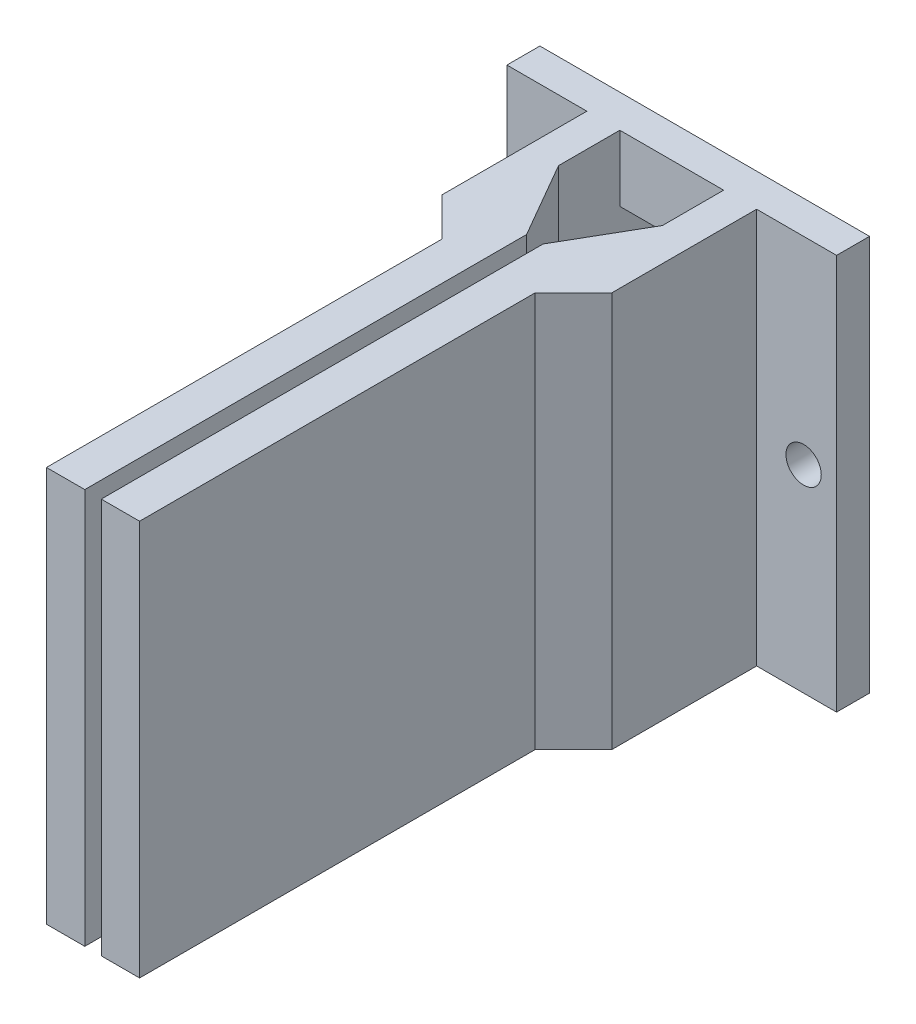
ISO-10303-21;
HEADER;
FILE_DESCRIPTION(('STEP AP214'),'2;1');
FILE_NAME('part.step','',(''),(''),'','','');
FILE_SCHEMA(('AUTOMOTIVE_DESIGN { 1 0 10303 214 1 1 1 1 }'));
ENDSEC;
DATA;
#1=APPLICATION_CONTEXT('core data for automotive mechanical design processes');
#2=APPLICATION_PROTOCOL_DEFINITION('international standard','automotive_design',2000,#1);
#3=PRODUCT_CONTEXT('',#1,'mechanical');
#4=PRODUCT('Part','Part','',(#3));
#5=PRODUCT_RELATED_PRODUCT_CATEGORY('part','',(#4));
#6=PRODUCT_DEFINITION_FORMATION('','',#4);
#7=PRODUCT_DEFINITION_CONTEXT('part definition',#1,'design');
#8=PRODUCT_DEFINITION('design','',#6,#7);
#9=PRODUCT_DEFINITION_SHAPE('','',#8);
#10=(LENGTH_UNIT() NAMED_UNIT(*) SI_UNIT(.MILLI.,.METRE.));
#11=(NAMED_UNIT(*) PLANE_ANGLE_UNIT() SI_UNIT($,.RADIAN.));
#12=(NAMED_UNIT(*) SI_UNIT($,.STERADIAN.) SOLID_ANGLE_UNIT());
#13=UNCERTAINTY_MEASURE_WITH_UNIT(LENGTH_MEASURE(1.E-05),#10,'distance_accuracy_value','');
#14=(GEOMETRIC_REPRESENTATION_CONTEXT(3) GLOBAL_UNCERTAINTY_ASSIGNED_CONTEXT((#13)) GLOBAL_UNIT_ASSIGNED_CONTEXT((#10,
#11,#12)) REPRESENTATION_CONTEXT('',''));
#15=CARTESIAN_POINT('',(0.,0.,0.));
#16=DIRECTION('',(0.,0.,1.));
#17=DIRECTION('',(1.,0.,0.));
#18=AXIS2_PLACEMENT_3D('',#15,#16,#17);
#19=CARTESIAN_POINT('',(2.76353743039078E-13,63.225,43.4600108538336));
#20=DIRECTION('',(0.,1.,0.));
#21=DIRECTION('',(-1.,0.,0.));
#22=AXIS2_PLACEMENT_3D('',#19,#20,#21);
#23=PLANE('',#22);
#24=DIRECTION('',(0.,0.,-1.));
#25=VECTOR('',#24,1.);
#26=CARTESIAN_POINT('',(5.,63.225,10.1125));
#27=LINE('',#26,#25);
#28=CARTESIAN_POINT('',(5.,63.225,11.0759532617103));
#29=VERTEX_POINT('',#28);
#30=CARTESIAN_POINT('',(5.,63.225,5.175));
#31=VERTEX_POINT('',#30);
#32=EDGE_CURVE('E390',#29,#31,#27,.T.);
#33=ORIENTED_EDGE('',*,*,#32,.T.);
#34=DIRECTION('',(-1.,0.,0.));
#35=VECTOR('',#34,1.);
#36=CARTESIAN_POINT('',(-4.99999999999998,63.225,5.175));
#37=LINE('',#36,#35);
#38=CARTESIAN_POINT('',(-4.99999999999998,63.225,5.175));
#39=VERTEX_POINT('',#38);
#40=EDGE_CURVE('E212',#31,#39,#37,.T.);
#41=ORIENTED_EDGE('',*,*,#40,.T.);
#42=DIRECTION('',(0.,0.,-1.));
#43=VECTOR('',#42,1.);
#44=CARTESIAN_POINT('',(-4.99999999999998,63.225,10.1125));
#45=LINE('',#44,#43);
#46=CARTESIAN_POINT('',(-4.99999999999998,63.225,11.0759532617103));
#47=VERTEX_POINT('',#46);
#48=EDGE_CURVE('E297',#47,#39,#45,.T.);
#49=ORIENTED_EDGE('',*,*,#48,.F.);
#50=DIRECTION('',(-0.499999999999996,0.,-0.866025403784441));
#51=VECTOR('',#50,1.);
#52=CARTESIAN_POINT('',(-0.793749999999991,63.225,18.361391971047));
#53=LINE('',#52,#51);
#54=CARTESIAN_POINT('',(-0.793749999999991,63.225,18.361391971047));
#55=VERTEX_POINT('',#54);
#56=EDGE_CURVE('E319',#47,#55,#53,.F.);
#57=ORIENTED_EDGE('',*,*,#56,.T.);
#58=DIRECTION('',(0.,0.,-1.));
#59=VECTOR('',#58,1.);
#60=CARTESIAN_POINT('',(-0.793749999999991,63.225,60.9125));
#61=LINE('',#60,#59);
#62=CARTESIAN_POINT('',(-0.793749999999991,63.225,60.9125));
#63=VERTEX_POINT('',#62);
#64=EDGE_CURVE('E293',#63,#55,#61,.T.);
#65=ORIENTED_EDGE('',*,*,#64,.F.);
#66=DIRECTION('',(1.,0.,0.));
#67=VECTOR('',#66,1.);
#68=CARTESIAN_POINT('',(-8.17499999999998,63.225,60.9125));
#69=LINE('',#68,#67);
#70=CARTESIAN_POINT('',(-4.48437499999998,63.225,60.9125));
#71=VERTEX_POINT('',#70);
#72=EDGE_CURVE('E277',#71,#63,#69,.T.);
#73=ORIENTED_EDGE('',*,*,#72,.F.);
#74=DIRECTION('',(0.,0.,1.));
#75=VECTOR('',#74,1.);
#76=CARTESIAN_POINT('',(-4.48437499999998,63.225,16.4625));
#77=LINE('',#76,#75);
#78=CARTESIAN_POINT('',(-4.48437499999998,63.225,22.8125));
#79=VERTEX_POINT('',#78);
#80=EDGE_CURVE('E273',#79,#71,#77,.T.);
#81=ORIENTED_EDGE('',*,*,#80,.F.);
#82=DIRECTION('',(-0.707106781186551,0.,-0.707106781186544));
#83=VECTOR('',#82,1.);
#84=CARTESIAN_POINT('',(8.08156792691694,63.225,35.3784429269168));
#85=LINE('',#84,#83);
#86=CARTESIAN_POINT('',(-8.17499999999998,63.2250000000001,19.1218750000001));
#87=VERTEX_POINT('',#86);
#88=EDGE_CURVE('E337',#79,#87,#85,.T.);
#89=ORIENTED_EDGE('',*,*,#88,.T.);
#90=DIRECTION('',(0.,0.,-1.));
#91=VECTOR('',#90,1.);
#92=CARTESIAN_POINT('',(-8.17499999999998,63.225,43.4600108538336));
#93=LINE('',#92,#91);
#94=CARTESIAN_POINT('',(-8.17499999999998,63.225,5.175));
#95=VERTEX_POINT('',#94);
#96=EDGE_CURVE('E302',#87,#95,#93,.T.);
#97=ORIENTED_EDGE('',*,*,#96,.T.);
#98=DIRECTION('',(-1.,0.,0.));
#99=VECTOR('',#98,1.);
#100=CARTESIAN_POINT('',(15.875,63.225,5.175));
#101=LINE('',#100,#99);
#102=CARTESIAN_POINT('',(-15.875,63.225,5.175));
#103=VERTEX_POINT('',#102);
#104=EDGE_CURVE('E252',#95,#103,#101,.T.);
#105=ORIENTED_EDGE('',*,*,#104,.T.);
#106=DIRECTION('',(0.,0.,-1.));
#107=VECTOR('',#106,1.);
#108=CARTESIAN_POINT('',(-15.875,63.225,5.175));
#109=LINE('',#108,#107);
#110=CARTESIAN_POINT('',(-15.875,63.225,2.));
#111=VERTEX_POINT('',#110);
#112=EDGE_CURVE('E259',#103,#111,#109,.T.);
#113=ORIENTED_EDGE('',*,*,#112,.T.);
#114=DIRECTION('',(-1.,0.,0.));
#115=VECTOR('',#114,1.);
#116=CARTESIAN_POINT('',(15.875,63.225,2.));
#117=LINE('',#116,#115);
#118=CARTESIAN_POINT('',(15.875,63.225,2.));
#119=VERTEX_POINT('',#118);
#120=EDGE_CURVE('E455',#119,#111,#117,.T.);
#121=ORIENTED_EDGE('',*,*,#120,.F.);
#122=DIRECTION('',(0.,0.,-1.));
#123=VECTOR('',#122,1.);
#124=CARTESIAN_POINT('',(15.875,63.225,5.175));
#125=LINE('',#124,#123);
#126=CARTESIAN_POINT('',(15.875,63.225,5.175));
#127=VERTEX_POINT('',#126);
#128=EDGE_CURVE('E446',#127,#119,#125,.T.);
#129=ORIENTED_EDGE('',*,*,#128,.F.);
#130=DIRECTION('',(-1.,0.,0.));
#131=VECTOR('',#130,1.);
#132=CARTESIAN_POINT('',(15.875,63.225,5.175));
#133=LINE('',#132,#131);
#134=CARTESIAN_POINT('',(8.175,63.225,5.175));
#135=VERTEX_POINT('',#134);
#136=EDGE_CURVE('E379',#127,#135,#133,.T.);
#137=ORIENTED_EDGE('',*,*,#136,.T.);
#138=DIRECTION('',(0.,0.,-1.));
#139=VECTOR('',#138,1.);
#140=CARTESIAN_POINT('',(8.17499999999999,63.225,43.4600108538336));
#141=LINE('',#140,#139);
#142=CARTESIAN_POINT('',(8.17499999999999,63.225,19.1218750000001));
#143=VERTEX_POINT('',#142);
#144=EDGE_CURVE('E406',#143,#135,#141,.T.);
#145=ORIENTED_EDGE('',*,*,#144,.F.);
#146=DIRECTION('',(0.707106781186551,0.,-0.707106781186544));
#147=VECTOR('',#146,1.);
#148=CARTESIAN_POINT('',(-8.08156792691666,63.2250000000001,35.3784429269166));
#149=LINE('',#148,#147);
#150=CARTESIAN_POINT('',(4.48437500000001,63.225,22.8125));
#151=VERTEX_POINT('',#150);
#152=EDGE_CURVE('E53',#143,#151,#149,.F.);
#153=ORIENTED_EDGE('',*,*,#152,.T.);
#154=DIRECTION('',(0.,0.,1.));
#155=VECTOR('',#154,1.);
#156=CARTESIAN_POINT('',(4.48437500000001,63.225,16.4625));
#157=LINE('',#156,#155);
#158=CARTESIAN_POINT('',(4.48437500000001,63.225,60.9125));
#159=VERTEX_POINT('',#158);
#160=EDGE_CURVE('E422',#151,#159,#157,.T.);
#161=ORIENTED_EDGE('',*,*,#160,.T.);
#162=DIRECTION('',(1.,0.,0.));
#163=VECTOR('',#162,1.);
#164=CARTESIAN_POINT('',(8.175,63.225,60.9125));
#165=LINE('',#164,#163);
#166=CARTESIAN_POINT('',(0.793750000000009,63.225,60.9125));
#167=VERTEX_POINT('',#166);
#168=EDGE_CURVE('E396',#167,#159,#165,.T.);
#169=ORIENTED_EDGE('',*,*,#168,.F.);
#170=DIRECTION('',(0.,0.,-1.));
#171=VECTOR('',#170,1.);
#172=CARTESIAN_POINT('',(0.793750000000009,63.225,60.9125));
#173=LINE('',#172,#171);
#174=CARTESIAN_POINT('',(0.793750000000009,63.225,18.361391971047));
#175=VERTEX_POINT('',#174);
#176=EDGE_CURVE('E391',#167,#175,#173,.T.);
#177=ORIENTED_EDGE('',*,*,#176,.T.);
#178=DIRECTION('',(0.499999999999996,0.,-0.866025403784441));
#179=VECTOR('',#178,1.);
#180=CARTESIAN_POINT('',(0.793749999999967,63.225,18.361391971047));
#181=LINE('',#180,#179);
#182=EDGE_CURVE('E386',#175,#29,#181,.T.);
#183=ORIENTED_EDGE('',*,*,#182,.T.);
#184=EDGE_LOOP('',(#33,#41,#49,#57,#65,#73,#81,#89,#97,#105,#113,#121,#129,#137,#145,#153,#161,
#169,#177,#183));
#185=FACE_BOUND('',#184,.T.);
#186=ADVANCED_FACE('F43',(#185),#23,.F.);
#187=CARTESIAN_POINT('',(0.,101.325,43.4600108538336));
#188=DIRECTION('',(0.,1.,0.));
#189=DIRECTION('',(0.,0.,1.));
#190=AXIS2_PLACEMENT_3D('',#187,#188,#189);
#191=PLANE('',#190);
#192=DIRECTION('',(0.,0.,-1.));
#193=VECTOR('',#192,1.);
#194=CARTESIAN_POINT('',(15.875,101.325,5.175));
#195=LINE('',#194,#193);
#196=CARTESIAN_POINT('',(15.875,101.325,5.175));
#197=VERTEX_POINT('',#196);
#198=CARTESIAN_POINT('',(15.875,101.325,2.));
#199=VERTEX_POINT('',#198);
#200=EDGE_CURVE('E410',#197,#199,#195,.T.);
#201=ORIENTED_EDGE('',*,*,#200,.T.);
#202=DIRECTION('',(-1.,0.,0.));
#203=VECTOR('',#202,1.);
#204=CARTESIAN_POINT('',(0.,101.325,2.));
#205=LINE('',#204,#203);
#206=CARTESIAN_POINT('',(-15.875,101.325,2.));
#207=VERTEX_POINT('',#206);
#208=EDGE_CURVE('E401',#199,#207,#205,.T.);
#209=ORIENTED_EDGE('',*,*,#208,.T.);
#210=DIRECTION('',(0.,0.,-1.));
#211=VECTOR('',#210,1.);
#212=CARTESIAN_POINT('',(-15.875,101.325,5.175));
#213=LINE('',#212,#211);
#214=CARTESIAN_POINT('',(-15.875,101.325,5.175));
#215=VERTEX_POINT('',#214);
#216=EDGE_CURVE('E255',#215,#207,#213,.T.);
#217=ORIENTED_EDGE('',*,*,#216,.F.);
#218=DIRECTION('',(1.,0.,0.));
#219=VECTOR('',#218,1.);
#220=CARTESIAN_POINT('',(15.875,101.325,5.175));
#221=LINE('',#220,#219);
#222=CARTESIAN_POINT('',(-8.17499999999998,101.325,5.175));
#223=VERTEX_POINT('',#222);
#224=EDGE_CURVE('E248',#215,#223,#221,.T.);
#225=ORIENTED_EDGE('',*,*,#224,.T.);
#226=DIRECTION('',(0.,0.,-1.));
#227=VECTOR('',#226,1.);
#228=CARTESIAN_POINT('',(-8.17499999999998,101.325,43.4600108538336));
#229=LINE('',#228,#227);
#230=CARTESIAN_POINT('',(-8.17499999999998,101.325,19.1218750000001));
#231=VERTEX_POINT('',#230);
#232=EDGE_CURVE('E305',#231,#223,#229,.T.);
#233=ORIENTED_EDGE('',*,*,#232,.F.);
#234=DIRECTION('',(0.707106781186551,0.,0.707106781186544));
#235=VECTOR('',#234,1.);
#236=CARTESIAN_POINT('',(-10.8343750000001,101.325,16.4625));
#237=LINE('',#236,#235);
#238=CARTESIAN_POINT('',(-4.48437499999999,101.325,22.8125));
#239=VERTEX_POINT('',#238);
#240=EDGE_CURVE('E334',#231,#239,#237,.T.);
#241=ORIENTED_EDGE('',*,*,#240,.T.);
#242=DIRECTION('',(0.,0.,1.));
#243=VECTOR('',#242,1.);
#244=CARTESIAN_POINT('',(-4.48437499999999,101.325,16.4625));
#245=LINE('',#244,#243);
#246=CARTESIAN_POINT('',(-4.48437499999999,101.325,60.9125));
#247=VERTEX_POINT('',#246);
#248=EDGE_CURVE('E274',#239,#247,#245,.T.);
#249=ORIENTED_EDGE('',*,*,#248,.T.);
#250=DIRECTION('',(-1.,0.,0.));
#251=VECTOR('',#250,1.);
#252=CARTESIAN_POINT('',(-8.17499999999998,101.325,60.9125));
#253=LINE('',#252,#251);
#254=CARTESIAN_POINT('',(-0.793749999999991,101.325,60.9125));
#255=VERTEX_POINT('',#254);
#256=EDGE_CURVE('E285',#255,#247,#253,.T.);
#257=ORIENTED_EDGE('',*,*,#256,.F.);
#258=DIRECTION('',(0.,0.,-1.));
#259=VECTOR('',#258,1.);
#260=CARTESIAN_POINT('',(-0.793749999999991,101.325,60.9125));
#261=LINE('',#260,#259);
#262=CARTESIAN_POINT('',(-0.793749999999991,101.325,18.361391971047));
#263=VERTEX_POINT('',#262);
#264=EDGE_CURVE('E289',#255,#263,#261,.T.);
#265=ORIENTED_EDGE('',*,*,#264,.T.);
#266=DIRECTION('',(0.499999999999996,0.,0.866025403784441));
#267=VECTOR('',#266,1.);
#268=CARTESIAN_POINT('',(10.2727082761985,101.325,37.529059965264));
#269=LINE('',#268,#267);
#270=CARTESIAN_POINT('',(-4.99999999999998,101.325,11.0759532617103));
#271=VERTEX_POINT('',#270);
#272=EDGE_CURVE('E315',#263,#271,#269,.F.);
#273=ORIENTED_EDGE('',*,*,#272,.T.);
#274=DIRECTION('',(0.,0.,-1.));
#275=VECTOR('',#274,1.);
#276=CARTESIAN_POINT('',(-4.99999999999998,101.325,10.1125));
#277=LINE('',#276,#275);
#278=CARTESIAN_POINT('',(-4.99999999999998,101.325,5.175));
#279=VERTEX_POINT('',#278);
#280=EDGE_CURVE('E298',#271,#279,#277,.T.);
#281=ORIENTED_EDGE('',*,*,#280,.T.);
#282=DIRECTION('',(1.,0.,0.));
#283=VECTOR('',#282,1.);
#284=CARTESIAN_POINT('',(5.,101.325,5.175));
#285=LINE('',#284,#283);
#286=CARTESIAN_POINT('',(5.,101.325,5.175));
#287=VERTEX_POINT('',#286);
#288=EDGE_CURVE('E357',#279,#287,#285,.T.);
#289=ORIENTED_EDGE('',*,*,#288,.T.);
#290=DIRECTION('',(0.,0.,-1.));
#291=VECTOR('',#290,1.);
#292=CARTESIAN_POINT('',(5.,101.325,10.1125));
#293=LINE('',#292,#291);
#294=CARTESIAN_POINT('',(5.,101.325,11.0759532617103));
#295=VERTEX_POINT('',#294);
#296=EDGE_CURVE('E385',#295,#287,#293,.T.);
#297=ORIENTED_EDGE('',*,*,#296,.F.);
#298=DIRECTION('',(-0.499999999999996,0.,0.866025403784441));
#299=VECTOR('',#298,1.);
#300=CARTESIAN_POINT('',(-10.2727082761985,101.325,37.529059965264));
#301=LINE('',#300,#299);
#302=CARTESIAN_POINT('',(0.793750000000009,101.325,18.361391971047));
#303=VERTEX_POINT('',#302);
#304=EDGE_CURVE('E397',#295,#303,#301,.T.);
#305=ORIENTED_EDGE('',*,*,#304,.T.);
#306=DIRECTION('',(0.,0.,-1.));
#307=VECTOR('',#306,1.);
#308=CARTESIAN_POINT('',(0.793750000000009,101.325,60.9125));
#309=LINE('',#308,#307);
#310=CARTESIAN_POINT('',(0.793750000000009,101.325,60.9125));
#311=VERTEX_POINT('',#310);
#312=EDGE_CURVE('E384',#311,#303,#309,.T.);
#313=ORIENTED_EDGE('',*,*,#312,.F.);
#314=DIRECTION('',(-1.,0.,0.));
#315=VECTOR('',#314,1.);
#316=CARTESIAN_POINT('',(8.175,101.325,60.9125));
#317=LINE('',#316,#315);
#318=CARTESIAN_POINT('',(4.484375,101.325,60.9125));
#319=VERTEX_POINT('',#318);
#320=EDGE_CURVE('E426',#319,#311,#317,.T.);
#321=ORIENTED_EDGE('',*,*,#320,.F.);
#322=DIRECTION('',(0.,0.,1.));
#323=VECTOR('',#322,1.);
#324=CARTESIAN_POINT('',(4.484375,101.325,16.4625));
#325=LINE('',#324,#323);
#326=CARTESIAN_POINT('',(4.484375,101.325,22.8125));
#327=VERTEX_POINT('',#326);
#328=EDGE_CURVE('E433',#327,#319,#325,.T.);
#329=ORIENTED_EDGE('',*,*,#328,.F.);
#330=DIRECTION('',(-0.707106781186551,0.,0.707106781186544));
#331=VECTOR('',#330,1.);
#332=CARTESIAN_POINT('',(10.8343750000001,101.325,16.4625));
#333=LINE('',#332,#331);
#334=CARTESIAN_POINT('',(8.175,101.325,19.1218750000001));
#335=VERTEX_POINT('',#334);
#336=EDGE_CURVE('E11',#327,#335,#333,.F.);
#337=ORIENTED_EDGE('',*,*,#336,.T.);
#338=DIRECTION('',(0.,0.,-1.));
#339=VECTOR('',#338,1.);
#340=CARTESIAN_POINT('',(8.175,101.325,43.4600108538336));
#341=LINE('',#340,#339);
#342=CARTESIAN_POINT('',(8.175,101.325,5.175));
#343=VERTEX_POINT('',#342);
#344=EDGE_CURVE('E400',#335,#343,#341,.T.);
#345=ORIENTED_EDGE('',*,*,#344,.T.);
#346=DIRECTION('',(1.,0.,0.));
#347=VECTOR('',#346,1.);
#348=CARTESIAN_POINT('',(15.875,101.325,5.175));
#349=LINE('',#348,#347);
#350=EDGE_CURVE('E405',#343,#197,#349,.T.);
#351=ORIENTED_EDGE('',*,*,#350,.T.);
#352=EDGE_LOOP('',(#201,#209,#217,#225,#233,#241,#249,#257,#265,#273,#281,#289,#297,#305,#313,
#321,#329,#337,#345,#351));
#353=FACE_BOUND('',#352,.T.);
#354=ADVANCED_FACE('F490',(#353),#191,.T.);
#355=CARTESIAN_POINT('',(8.17499999999998,0.,43.4600108538336));
#356=DIRECTION('',(1.,0.,0.));
#357=DIRECTION('',(0.,1.,0.));
#358=AXIS2_PLACEMENT_3D('',#355,#356,#357);
#359=PLANE('',#358);
#360=DIRECTION('',(0.,-1.,0.));
#361=VECTOR('',#360,1.);
#362=CARTESIAN_POINT('',(8.17499999999998,0.,5.175));
#363=LINE('',#362,#361);
#364=EDGE_CURVE('E442',#343,#135,#363,.T.);
#365=ORIENTED_EDGE('',*,*,#364,.F.);
#366=ORIENTED_EDGE('',*,*,#344,.F.);
#367=DIRECTION('',(0.,1.,0.));
#368=VECTOR('',#367,1.);
#369=CARTESIAN_POINT('',(8.17499999999998,0.,19.1218750000001));
#370=LINE('',#369,#368);
#371=EDGE_CURVE('E474',#335,#143,#370,.F.);
#372=ORIENTED_EDGE('',*,*,#371,.T.);
#373=ORIENTED_EDGE('',*,*,#144,.T.);
#374=EDGE_LOOP('',(#365,#366,#372,#373));
#375=FACE_BOUND('',#374,.T.);
#376=ADVANCED_FACE('F559',(#375),#359,.T.);
#377=CARTESIAN_POINT('',(5.,101.325,10.1125));
#378=DIRECTION('',(1.,0.,0.));
#379=DIRECTION('',(0.,0.,-1.));
#380=AXIS2_PLACEMENT_3D('',#377,#378,#379);
#381=PLANE('',#380);
#382=DIRECTION('',(0.,1.,0.));
#383=VECTOR('',#382,1.);
#384=CARTESIAN_POINT('',(5.,63.225,2.));
#385=LINE('',#384,#383);
#386=CARTESIAN_POINT('',(5.,69.575,2.));
#387=VERTEX_POINT('',#386);
#388=CARTESIAN_POINT('',(5.,94.975,2.));
#389=VERTEX_POINT('',#388);
#390=EDGE_CURVE('E227',#387,#389,#385,.T.);
#391=ORIENTED_EDGE('',*,*,#390,.F.);
#392=DIRECTION('',(0.,0.,-1.));
#393=VECTOR('',#392,1.);
#394=CARTESIAN_POINT('',(5.,69.575,5.175));
#395=LINE('',#394,#393);
#396=CARTESIAN_POINT('',(5.,69.575,5.175));
#397=VERTEX_POINT('',#396);
#398=EDGE_CURVE('E220',#397,#387,#395,.T.);
#399=ORIENTED_EDGE('',*,*,#398,.F.);
#400=DIRECTION('',(0.,-1.,0.));
#401=VECTOR('',#400,1.);
#402=CARTESIAN_POINT('',(5.,63.225,5.175));
#403=LINE('',#402,#401);
#404=EDGE_CURVE('E207',#397,#31,#403,.T.);
#405=ORIENTED_EDGE('',*,*,#404,.T.);
#406=ORIENTED_EDGE('',*,*,#32,.F.);
#407=DIRECTION('',(0.,1.,0.));
#408=VECTOR('',#407,1.);
#409=CARTESIAN_POINT('',(5.,101.325,11.0759532617103));
#410=LINE('',#409,#408);
#411=EDGE_CURVE('E380',#29,#295,#410,.T.);
#412=ORIENTED_EDGE('',*,*,#411,.T.);
#413=ORIENTED_EDGE('',*,*,#296,.T.);
#414=DIRECTION('',(0.,-1.,0.));
#415=VECTOR('',#414,1.);
#416=CARTESIAN_POINT('',(5.,101.325,5.175));
#417=LINE('',#416,#415);
#418=CARTESIAN_POINT('',(5.,94.975,5.175));
#419=VERTEX_POINT('',#418);
#420=EDGE_CURVE('E345',#287,#419,#417,.T.);
#421=ORIENTED_EDGE('',*,*,#420,.T.);
#422=DIRECTION('',(0.,0.,-1.));
#423=VECTOR('',#422,1.);
#424=CARTESIAN_POINT('',(5.,94.975,5.175));
#425=LINE('',#424,#423);
#426=EDGE_CURVE('E361',#419,#389,#425,.T.);
#427=ORIENTED_EDGE('',*,*,#426,.T.);
#428=EDGE_LOOP('',(#391,#399,#405,#406,#412,#413,#421,#427));
#429=FACE_BOUND('',#428,.T.);
#430=ADVANCED_FACE('F225',(#429),#381,.F.);
#431=CARTESIAN_POINT('',(0.793750000000009,101.325,60.9125));
#432=DIRECTION('',(1.,0.,0.));
#433=DIRECTION('',(0.,0.,-1.));
#434=AXIS2_PLACEMENT_3D('',#431,#432,#433);
#435=PLANE('',#434);
#436=ORIENTED_EDGE('',*,*,#312,.T.);
#437=DIRECTION('',(0.,-1.,0.));
#438=VECTOR('',#437,1.);
#439=CARTESIAN_POINT('',(0.793750000000009,63.225,18.361391971047));
#440=LINE('',#439,#438);
#441=EDGE_CURVE('E392',#303,#175,#440,.T.);
#442=ORIENTED_EDGE('',*,*,#441,.T.);
#443=ORIENTED_EDGE('',*,*,#176,.F.);
#444=DIRECTION('',(0.,-1.,0.));
#445=VECTOR('',#444,1.);
#446=CARTESIAN_POINT('',(0.793750000000009,101.325,60.9125));
#447=LINE('',#446,#445);
#448=EDGE_CURVE('E427',#311,#167,#447,.T.);
#449=ORIENTED_EDGE('',*,*,#448,.F.);
#450=EDGE_LOOP('',(#436,#442,#443,#449));
#451=FACE_BOUND('',#450,.T.);
#452=ADVANCED_FACE('F499',(#451),#435,.F.);
#453=CARTESIAN_POINT('',(0.,0.,60.9125));
#454=DIRECTION('',(0.,0.,-1.));
#455=DIRECTION('',(-1.,0.,0.));
#456=AXIS2_PLACEMENT_3D('',#453,#454,#455);
#457=PLANE('',#456);
#458=ORIENTED_EDGE('',*,*,#168,.T.);
#459=DIRECTION('',(0.,-1.,0.));
#460=VECTOR('',#459,1.);
#461=CARTESIAN_POINT('',(4.484375,101.325,60.9125));
#462=LINE('',#461,#460);
#463=EDGE_CURVE('E430',#319,#159,#462,.T.);
#464=ORIENTED_EDGE('',*,*,#463,.F.);
#465=ORIENTED_EDGE('',*,*,#320,.T.);
#466=ORIENTED_EDGE('',*,*,#448,.T.);
#467=EDGE_LOOP('',(#458,#464,#465,#466));
#468=FACE_BOUND('',#467,.T.);
#469=ADVANCED_FACE('F494',(#468),#457,.F.);
#470=CARTESIAN_POINT('',(4.484375,101.325,16.4625));
#471=DIRECTION('',(-1.,0.,0.));
#472=DIRECTION('',(0.,-1.,0.));
#473=AXIS2_PLACEMENT_3D('',#470,#471,#472);
#474=PLANE('',#473);
#475=ORIENTED_EDGE('',*,*,#160,.F.);
#476=DIRECTION('',(0.,1.,0.));
#477=VECTOR('',#476,1.);
#478=CARTESIAN_POINT('',(4.484375,101.325,22.8125));
#479=LINE('',#478,#477);
#480=EDGE_CURVE('E461',#151,#327,#479,.T.);
#481=ORIENTED_EDGE('',*,*,#480,.T.);
#482=ORIENTED_EDGE('',*,*,#328,.T.);
#483=ORIENTED_EDGE('',*,*,#463,.T.);
#484=EDGE_LOOP('',(#475,#481,#482,#483));
#485=FACE_BOUND('',#484,.T.);
#486=ADVANCED_FACE('F486',(#485),#474,.F.);
#487=CARTESIAN_POINT('',(0.793750000000009,101.325,18.361391971047));
#488=DIRECTION('',(-0.866025403784441,0.,-0.499999999999996));
#489=DIRECTION('',(0.,1.,0.));
#490=AXIS2_PLACEMENT_3D('',#487,#488,#489);
#491=PLANE('',#490);
#492=ORIENTED_EDGE('',*,*,#304,.F.);
#493=ORIENTED_EDGE('',*,*,#411,.F.);
#494=ORIENTED_EDGE('',*,*,#182,.F.);
#495=ORIENTED_EDGE('',*,*,#441,.F.);
#496=EDGE_LOOP('',(#492,#493,#494,#495));
#497=FACE_BOUND('',#496,.T.);
#498=ADVANCED_FACE('F503',(#497),#491,.T.);
#499=CARTESIAN_POINT('',(15.875,63.225,5.175));
#500=DIRECTION('',(1.,0.,0.));
#501=DIRECTION('',(0.,0.,-1.));
#502=AXIS2_PLACEMENT_3D('',#499,#500,#501);
#503=PLANE('',#502);
#504=DIRECTION('',(0.,-1.,0.));
#505=VECTOR('',#504,1.);
#506=CARTESIAN_POINT('',(15.875,63.225,2.));
#507=LINE('',#506,#505);
#508=EDGE_CURVE('E445',#199,#119,#507,.T.);
#509=ORIENTED_EDGE('',*,*,#508,.F.);
#510=ORIENTED_EDGE('',*,*,#200,.F.);
#511=DIRECTION('',(0.,-1.,0.));
#512=VECTOR('',#511,1.);
#513=CARTESIAN_POINT('',(15.875,63.225,5.175));
#514=LINE('',#513,#512);
#515=EDGE_CURVE('E436',#197,#127,#514,.T.);
#516=ORIENTED_EDGE('',*,*,#515,.T.);
#517=ORIENTED_EDGE('',*,*,#128,.T.);
#518=EDGE_LOOP('',(#509,#510,#516,#517));
#519=FACE_BOUND('',#518,.T.);
#520=ADVANCED_FACE('F552',(#519),#503,.T.);
#521=CARTESIAN_POINT('',(0.,0.,5.175));
#522=DIRECTION('',(0.,0.,1.));
#523=DIRECTION('',(1.,0.,0.));
#524=AXIS2_PLACEMENT_3D('',#521,#522,#523);
#525=PLANE('',#524);
#526=CARTESIAN_POINT('',(12.7,82.275,5.175));
#527=DIRECTION('',(0.,0.,1.));
#528=DIRECTION('',(1.,0.,0.));
#529=AXIS2_PLACEMENT_3D('',#526,#527,#528);
#530=CIRCLE('',#529,1.69999999999999);
#531=CARTESIAN_POINT('',(14.4,82.275,5.175));
#532=VERTEX_POINT('',#531);
#533=EDGE_CURVE('E375',#532,#532,#530,.T.);
#534=ORIENTED_EDGE('',*,*,#533,.F.);
#535=EDGE_LOOP('',(#534));
#536=FACE_BOUND('',#535,.T.);
#537=ORIENTED_EDGE('',*,*,#350,.F.);
#538=ORIENTED_EDGE('',*,*,#364,.T.);
#539=ORIENTED_EDGE('',*,*,#136,.F.);
#540=ORIENTED_EDGE('',*,*,#515,.F.);
#541=EDGE_LOOP('',(#537,#538,#539,#540));
#542=FACE_BOUND('',#541,.T.);
#543=ADVANCED_FACE('F556',(#536,#542),#525,.T.);
#544=CARTESIAN_POINT('',(0.,0.,2.));
#545=DIRECTION('',(0.,0.,1.));
#546=DIRECTION('',(1.,0.,0.));
#547=AXIS2_PLACEMENT_3D('',#544,#545,#546);
#548=PLANE('',#547);
#549=DIRECTION('',(1.,0.,0.));
#550=VECTOR('',#549,1.);
#551=CARTESIAN_POINT('',(-4.99999999999998,69.575,2.));
#552=LINE('',#551,#550);
#553=CARTESIAN_POINT('',(-4.99999999999998,69.575,2.));
#554=VERTEX_POINT('',#553);
#555=EDGE_CURVE('E60',#554,#387,#552,.T.);
#556=ORIENTED_EDGE('',*,*,#555,.T.);
#557=ORIENTED_EDGE('',*,*,#390,.T.);
#558=DIRECTION('',(-1.,0.,0.));
#559=VECTOR('',#558,1.);
#560=CARTESIAN_POINT('',(5.,94.975,2.));
#561=LINE('',#560,#559);
#562=CARTESIAN_POINT('',(-4.99999999999998,94.975,2.));
#563=VERTEX_POINT('',#562);
#564=EDGE_CURVE('E341',#389,#563,#561,.T.);
#565=ORIENTED_EDGE('',*,*,#564,.T.);
#566=DIRECTION('',(0.,1.,0.));
#567=VECTOR('',#566,1.);
#568=CARTESIAN_POINT('',(-4.99999999999998,63.225,2.));
#569=LINE('',#568,#567);
#570=EDGE_CURVE('E240',#554,#563,#569,.T.);
#571=ORIENTED_EDGE('',*,*,#570,.F.);
#572=EDGE_LOOP('',(#556,#557,#565,#571));
#573=FACE_BOUND('',#572,.T.);
#574=CARTESIAN_POINT('',(12.7,82.275,2.));
#575=DIRECTION('',(0.,0.,-1.));
#576=DIRECTION('',(-1.,0.,0.));
#577=AXIS2_PLACEMENT_3D('',#574,#575,#576);
#578=CIRCLE('',#577,1.69999999999999);
#579=CARTESIAN_POINT('',(11.,82.275,2.));
#580=VERTEX_POINT('',#579);
#581=EDGE_CURVE('E369',#580,#580,#578,.T.);
#582=ORIENTED_EDGE('',*,*,#581,.F.);
#583=EDGE_LOOP('',(#582));
#584=FACE_BOUND('',#583,.T.);
#585=ORIENTED_EDGE('',*,*,#120,.T.);
#586=DIRECTION('',(0.,1.,0.));
#587=VECTOR('',#586,1.);
#588=CARTESIAN_POINT('',(-15.875,63.225,2.));
#589=LINE('',#588,#587);
#590=EDGE_CURVE('E243',#111,#207,#589,.T.);
#591=ORIENTED_EDGE('',*,*,#590,.T.);
#592=ORIENTED_EDGE('',*,*,#208,.F.);
#593=ORIENTED_EDGE('',*,*,#508,.T.);
#594=EDGE_LOOP('',(#585,#591,#592,#593));
#595=FACE_BOUND('',#594,.T.);
#596=CARTESIAN_POINT('',(-12.7,82.275,2.));
#597=DIRECTION('',(0.,0.,-1.));
#598=DIRECTION('',(-1.,0.,0.));
#599=AXIS2_PLACEMENT_3D('',#596,#597,#598);
#600=CIRCLE('',#599,1.69999999999999);
#601=CARTESIAN_POINT('',(-14.4,82.275,2.));
#602=VERTEX_POINT('',#601);
#603=EDGE_CURVE('E229',#602,#602,#600,.T.);
#604=ORIENTED_EDGE('',*,*,#603,.F.);
#605=EDGE_LOOP('',(#604));
#606=FACE_BOUND('',#605,.T.);
#607=ADVANCED_FACE('F547',(#573,#584,#595,#606),#548,.F.);
#608=CARTESIAN_POINT('',(10.8343750000001,0.,16.4625));
#609=DIRECTION('',(0.707106781186544,0.,0.707106781186551));
#610=DIRECTION('',(0.,1.,0.));
#611=AXIS2_PLACEMENT_3D('',#608,#609,#610);
#612=PLANE('',#611);
#613=ORIENTED_EDGE('',*,*,#336,.F.);
#614=ORIENTED_EDGE('',*,*,#480,.F.);
#615=ORIENTED_EDGE('',*,*,#152,.F.);
#616=ORIENTED_EDGE('',*,*,#371,.F.);
#617=EDGE_LOOP('',(#613,#614,#615,#616));
#618=FACE_BOUND('',#617,.T.);
#619=ADVANCED_FACE('F46',(#618),#612,.T.);
#620=CARTESIAN_POINT('',(12.7,82.275,2.));
#621=DIRECTION('',(0.,0.,-1.));
#622=DIRECTION('',(-1.,0.,0.));
#623=AXIS2_PLACEMENT_3D('',#620,#621,#622);
#624=CYLINDRICAL_SURFACE('',#623,1.69999999999999);
#625=ORIENTED_EDGE('',*,*,#533,.T.);
#626=EDGE_LOOP('',(#625));
#627=FACE_BOUND('',#626,.T.);
#628=ORIENTED_EDGE('',*,*,#581,.T.);
#629=EDGE_LOOP('',(#628));
#630=FACE_BOUND('',#629,.T.);
#631=ADVANCED_FACE('F618',(#627,#630),#624,.F.);
#632=CARTESIAN_POINT('',(5.,94.975,5.175));
#633=DIRECTION('',(0.,-1.,0.));
#634=DIRECTION('',(0.,0.,-1.));
#635=AXIS2_PLACEMENT_3D('',#632,#633,#634);
#636=PLANE('',#635);
#637=ORIENTED_EDGE('',*,*,#564,.F.);
#638=ORIENTED_EDGE('',*,*,#426,.F.);
#639=DIRECTION('',(-1.,0.,0.));
#640=VECTOR('',#639,1.);
#641=CARTESIAN_POINT('',(5.,94.975,5.175));
#642=LINE('',#641,#640);
#643=CARTESIAN_POINT('',(-4.99999999999998,94.975,5.175));
#644=VERTEX_POINT('',#643);
#645=EDGE_CURVE('E349',#419,#644,#642,.T.);
#646=ORIENTED_EDGE('',*,*,#645,.T.);
#647=DIRECTION('',(0.,0.,-1.));
#648=VECTOR('',#647,1.);
#649=CARTESIAN_POINT('',(-4.99999999999998,94.975,5.175));
#650=LINE('',#649,#648);
#651=EDGE_CURVE('E365',#644,#563,#650,.T.);
#652=ORIENTED_EDGE('',*,*,#651,.T.);
#653=EDGE_LOOP('',(#637,#638,#646,#652));
#654=FACE_BOUND('',#653,.T.);
#655=ADVANCED_FACE('F623',(#654),#636,.T.);
#656=CARTESIAN_POINT('',(0.,0.,5.175));
#657=DIRECTION('',(0.,0.,-1.));
#658=DIRECTION('',(-1.,0.,0.));
#659=AXIS2_PLACEMENT_3D('',#656,#657,#658);
#660=PLANE('',#659);
#661=ORIENTED_EDGE('',*,*,#420,.F.);
#662=ORIENTED_EDGE('',*,*,#288,.F.);
#663=DIRECTION('',(0.,1.,0.));
#664=VECTOR('',#663,1.);
#665=CARTESIAN_POINT('',(-4.99999999999998,101.325,5.175));
#666=LINE('',#665,#664);
#667=EDGE_CURVE('E353',#644,#279,#666,.T.);
#668=ORIENTED_EDGE('',*,*,#667,.F.);
#669=ORIENTED_EDGE('',*,*,#645,.F.);
#670=EDGE_LOOP('',(#661,#662,#668,#669));
#671=FACE_BOUND('',#670,.T.);
#672=ADVANCED_FACE('F632',(#671),#660,.F.);
#673=CARTESIAN_POINT('',(-0.793749999999991,101.325,60.9125));
#674=DIRECTION('',(-1.,0.,0.));
#675=DIRECTION('',(0.,0.,1.));
#676=AXIS2_PLACEMENT_3D('',#673,#674,#675);
#677=PLANE('',#676);
#678=ORIENTED_EDGE('',*,*,#64,.T.);
#679=DIRECTION('',(0.,1.,0.));
#680=VECTOR('',#679,1.);
#681=CARTESIAN_POINT('',(-0.793749999999991,101.325,18.361391971047));
#682=LINE('',#681,#680);
#683=EDGE_CURVE('E308',#55,#263,#682,.T.);
#684=ORIENTED_EDGE('',*,*,#683,.T.);
#685=ORIENTED_EDGE('',*,*,#264,.F.);
#686=DIRECTION('',(0.,1.,0.));
#687=VECTOR('',#686,1.);
#688=CARTESIAN_POINT('',(-0.793749999999991,101.325,60.9125));
#689=LINE('',#688,#687);
#690=EDGE_CURVE('E282',#63,#255,#689,.T.);
#691=ORIENTED_EDGE('',*,*,#690,.F.);
#692=EDGE_LOOP('',(#678,#684,#685,#691));
#693=FACE_BOUND('',#692,.T.);
#694=ADVANCED_FACE('F517',(#693),#677,.F.);
#695=CARTESIAN_POINT('',(0.,0.,60.9125));
#696=DIRECTION('',(0.,0.,1.));
#697=DIRECTION('',(1.,0.,0.));
#698=AXIS2_PLACEMENT_3D('',#695,#696,#697);
#699=PLANE('',#698);
#700=DIRECTION('',(0.,1.,0.));
#701=VECTOR('',#700,1.);
#702=CARTESIAN_POINT('',(-4.48437499999999,101.325,60.9125));
#703=LINE('',#702,#701);
#704=EDGE_CURVE('E269',#71,#247,#703,.T.);
#705=ORIENTED_EDGE('',*,*,#704,.F.);
#706=ORIENTED_EDGE('',*,*,#72,.T.);
#707=ORIENTED_EDGE('',*,*,#690,.T.);
#708=ORIENTED_EDGE('',*,*,#256,.T.);
#709=EDGE_LOOP('',(#705,#706,#707,#708));
#710=FACE_BOUND('',#709,.T.);
#711=ADVANCED_FACE('F523',(#710),#699,.T.);
#712=CARTESIAN_POINT('',(-4.48437499999999,101.325,16.4625));
#713=DIRECTION('',(1.,0.,0.));
#714=DIRECTION('',(0.,1.,0.));
#715=AXIS2_PLACEMENT_3D('',#712,#713,#714);
#716=PLANE('',#715);
#717=ORIENTED_EDGE('',*,*,#248,.F.);
#718=DIRECTION('',(0.,-1.,0.));
#719=VECTOR('',#718,1.);
#720=CARTESIAN_POINT('',(-4.48437499999999,101.325,22.8125));
#721=LINE('',#720,#719);
#722=EDGE_CURVE('E326',#239,#79,#721,.T.);
#723=ORIENTED_EDGE('',*,*,#722,.T.);
#724=ORIENTED_EDGE('',*,*,#80,.T.);
#725=ORIENTED_EDGE('',*,*,#704,.T.);
#726=EDGE_LOOP('',(#717,#723,#724,#725));
#727=FACE_BOUND('',#726,.T.);
#728=ADVANCED_FACE('F528',(#727),#716,.F.);
#729=CARTESIAN_POINT('',(-8.17499999999998,0.,43.4600108538336));
#730=DIRECTION('',(1.,0.,0.));
#731=DIRECTION('',(0.,0.,-1.));
#732=AXIS2_PLACEMENT_3D('',#729,#730,#731);
#733=PLANE('',#732);
#734=ORIENTED_EDGE('',*,*,#232,.T.);
#735=DIRECTION('',(0.,-1.,0.));
#736=VECTOR('',#735,1.);
#737=CARTESIAN_POINT('',(-8.17499999999998,0.,5.175));
#738=LINE('',#737,#736);
#739=EDGE_CURVE('E263',#223,#95,#738,.T.);
#740=ORIENTED_EDGE('',*,*,#739,.T.);
#741=ORIENTED_EDGE('',*,*,#96,.F.);
#742=DIRECTION('',(0.,1.,0.));
#743=VECTOR('',#742,1.);
#744=CARTESIAN_POINT('',(-8.17499999999998,0.,19.1218750000001));
#745=LINE('',#744,#743);
#746=EDGE_CURVE('E330',#87,#231,#745,.T.);
#747=ORIENTED_EDGE('',*,*,#746,.T.);
#748=EDGE_LOOP('',(#734,#740,#741,#747));
#749=FACE_BOUND('',#748,.T.);
#750=ADVANCED_FACE('F534',(#749),#733,.F.);
#751=CARTESIAN_POINT('',(0.,0.,5.175));
#752=DIRECTION('',(0.,0.,1.));
#753=DIRECTION('',(1.,0.,0.));
#754=AXIS2_PLACEMENT_3D('',#751,#752,#753);
#755=PLANE('',#754);
#756=CARTESIAN_POINT('',(-12.7,82.275,5.175));
#757=DIRECTION('',(0.,0.,1.));
#758=DIRECTION('',(1.,0.,0.));
#759=AXIS2_PLACEMENT_3D('',#756,#757,#758);
#760=CIRCLE('',#759,1.69999999999999);
#761=CARTESIAN_POINT('',(-11.,82.275,5.175));
#762=VERTEX_POINT('',#761);
#763=EDGE_CURVE('E234',#762,#762,#760,.T.);
#764=ORIENTED_EDGE('',*,*,#763,.F.);
#765=EDGE_LOOP('',(#764));
#766=FACE_BOUND('',#765,.T.);
#767=ORIENTED_EDGE('',*,*,#739,.F.);
#768=ORIENTED_EDGE('',*,*,#224,.F.);
#769=DIRECTION('',(0.,1.,0.));
#770=VECTOR('',#769,1.);
#771=CARTESIAN_POINT('',(-15.875,63.225,5.175));
#772=LINE('',#771,#770);
#773=EDGE_CURVE('E244',#103,#215,#772,.T.);
#774=ORIENTED_EDGE('',*,*,#773,.F.);
#775=ORIENTED_EDGE('',*,*,#104,.F.);
#776=EDGE_LOOP('',(#767,#768,#774,#775));
#777=FACE_BOUND('',#776,.T.);
#778=ADVANCED_FACE('F540',(#766,#777),#755,.T.);
#779=CARTESIAN_POINT('',(-0.793749999999991,101.325,18.361391971047));
#780=DIRECTION('',(-0.866025403784441,0.,0.499999999999996));
#781=DIRECTION('',(0.,1.,0.));
#782=AXIS2_PLACEMENT_3D('',#779,#780,#781);
#783=PLANE('',#782);
#784=ORIENTED_EDGE('',*,*,#56,.F.);
#785=DIRECTION('',(0.,1.,0.));
#786=VECTOR('',#785,1.);
#787=CARTESIAN_POINT('',(-4.99999999999998,101.325,11.0759532617103));
#788=LINE('',#787,#786);
#789=EDGE_CURVE('E322',#271,#47,#788,.F.);
#790=ORIENTED_EDGE('',*,*,#789,.F.);
#791=ORIENTED_EDGE('',*,*,#272,.F.);
#792=ORIENTED_EDGE('',*,*,#683,.F.);
#793=EDGE_LOOP('',(#784,#790,#791,#792));
#794=FACE_BOUND('',#793,.T.);
#795=ADVANCED_FACE('F514',(#794),#783,.F.);
#796=CARTESIAN_POINT('',(-15.875,63.225,5.175));
#797=DIRECTION('',(-1.,0.,0.));
#798=DIRECTION('',(0.,0.,1.));
#799=AXIS2_PLACEMENT_3D('',#796,#797,#798);
#800=PLANE('',#799);
#801=ORIENTED_EDGE('',*,*,#590,.F.);
#802=ORIENTED_EDGE('',*,*,#112,.F.);
#803=ORIENTED_EDGE('',*,*,#773,.T.);
#804=ORIENTED_EDGE('',*,*,#216,.T.);
#805=EDGE_LOOP('',(#801,#802,#803,#804));
#806=FACE_BOUND('',#805,.T.);
#807=ADVANCED_FACE('F544',(#806),#800,.T.);
#808=CARTESIAN_POINT('',(-4.99999999999998,101.325,10.1125));
#809=DIRECTION('',(1.,0.,0.));
#810=DIRECTION('',(0.,0.,-1.));
#811=AXIS2_PLACEMENT_3D('',#808,#809,#810);
#812=PLANE('',#811);
#813=DIRECTION('',(0.,0.,-1.));
#814=VECTOR('',#813,1.);
#815=CARTESIAN_POINT('',(-4.99999999999998,69.575,5.175));
#816=LINE('',#815,#814);
#817=CARTESIAN_POINT('',(-4.99999999999998,69.575,5.175));
#818=VERTEX_POINT('',#817);
#819=EDGE_CURVE('E222',#818,#554,#816,.T.);
#820=ORIENTED_EDGE('',*,*,#819,.T.);
#821=ORIENTED_EDGE('',*,*,#570,.T.);
#822=ORIENTED_EDGE('',*,*,#651,.F.);
#823=ORIENTED_EDGE('',*,*,#667,.T.);
#824=ORIENTED_EDGE('',*,*,#280,.F.);
#825=ORIENTED_EDGE('',*,*,#789,.T.);
#826=ORIENTED_EDGE('',*,*,#48,.T.);
#827=DIRECTION('',(0.,1.,0.));
#828=VECTOR('',#827,1.);
#829=CARTESIAN_POINT('',(-4.99999999999998,63.225,5.175));
#830=LINE('',#829,#828);
#831=EDGE_CURVE('E68',#39,#818,#830,.T.);
#832=ORIENTED_EDGE('',*,*,#831,.T.);
#833=EDGE_LOOP('',(#820,#821,#822,#823,#824,#825,#826,#832));
#834=FACE_BOUND('',#833,.T.);
#835=ADVANCED_FACE('F511',(#834),#812,.T.);
#836=CARTESIAN_POINT('',(-10.8343750000001,0.,16.4625));
#837=DIRECTION('',(0.707106781186544,0.,-0.707106781186551));
#838=DIRECTION('',(0.,1.,0.));
#839=AXIS2_PLACEMENT_3D('',#836,#837,#838);
#840=PLANE('',#839);
#841=ORIENTED_EDGE('',*,*,#88,.F.);
#842=ORIENTED_EDGE('',*,*,#722,.F.);
#843=ORIENTED_EDGE('',*,*,#240,.F.);
#844=ORIENTED_EDGE('',*,*,#746,.F.);
#845=EDGE_LOOP('',(#841,#842,#843,#844));
#846=FACE_BOUND('',#845,.T.);
#847=ADVANCED_FACE('F532',(#846),#840,.F.);
#848=CARTESIAN_POINT('',(-12.7,82.275,2.));
#849=DIRECTION('',(0.,0.,-1.));
#850=DIRECTION('',(-1.,0.,0.));
#851=AXIS2_PLACEMENT_3D('',#848,#849,#850);
#852=CYLINDRICAL_SURFACE('',#851,1.69999999999999);
#853=ORIENTED_EDGE('',*,*,#763,.T.);
#854=EDGE_LOOP('',(#853));
#855=FACE_BOUND('',#854,.T.);
#856=ORIENTED_EDGE('',*,*,#603,.T.);
#857=EDGE_LOOP('',(#856));
#858=FACE_BOUND('',#857,.T.);
#859=ADVANCED_FACE('F692',(#855,#858),#852,.F.);
#860=CARTESIAN_POINT('',(-4.99999999999998,69.575,5.175));
#861=DIRECTION('',(0.,1.,0.));
#862=DIRECTION('',(0.,0.,1.));
#863=AXIS2_PLACEMENT_3D('',#860,#861,#862);
#864=PLANE('',#863);
#865=ORIENTED_EDGE('',*,*,#555,.F.);
#866=ORIENTED_EDGE('',*,*,#819,.F.);
#867=DIRECTION('',(1.,0.,0.));
#868=VECTOR('',#867,1.);
#869=CARTESIAN_POINT('',(-4.99999999999998,69.575,5.175));
#870=LINE('',#869,#868);
#871=EDGE_CURVE('E210',#818,#397,#870,.T.);
#872=ORIENTED_EDGE('',*,*,#871,.T.);
#873=ORIENTED_EDGE('',*,*,#398,.T.);
#874=EDGE_LOOP('',(#865,#866,#872,#873));
#875=FACE_BOUND('',#874,.T.);
#876=ADVANCED_FACE('F219',(#875),#864,.T.);
#877=CARTESIAN_POINT('',(0.,0.,5.175));
#878=DIRECTION('',(0.,0.,-1.));
#879=DIRECTION('',(-1.,0.,0.));
#880=AXIS2_PLACEMENT_3D('',#877,#878,#879);
#881=PLANE('',#880);
#882=ORIENTED_EDGE('',*,*,#831,.F.);
#883=ORIENTED_EDGE('',*,*,#40,.F.);
#884=ORIENTED_EDGE('',*,*,#404,.F.);
#885=ORIENTED_EDGE('',*,*,#871,.F.);
#886=EDGE_LOOP('',(#882,#883,#884,#885));
#887=FACE_BOUND('',#886,.T.);
#888=ADVANCED_FACE('F209',(#887),#881,.F.);
#889=CLOSED_SHELL('',(#186,#354,#376,#430,#452,#469,#486,#498,#520,#543,#607,#619,#631,#655,
#672,#694,#711,#728,#750,#778,#795,#807,#835,#847,#859,#876,#888));
#890=MANIFOLD_SOLID_BREP('B2',#889);
#891=ADVANCED_BREP_SHAPE_REPRESENTATION('',(#18,#890),#14);
#892=SHAPE_DEFINITION_REPRESENTATION(#9,#891);
ENDSEC;
END-ISO-10303-21;
